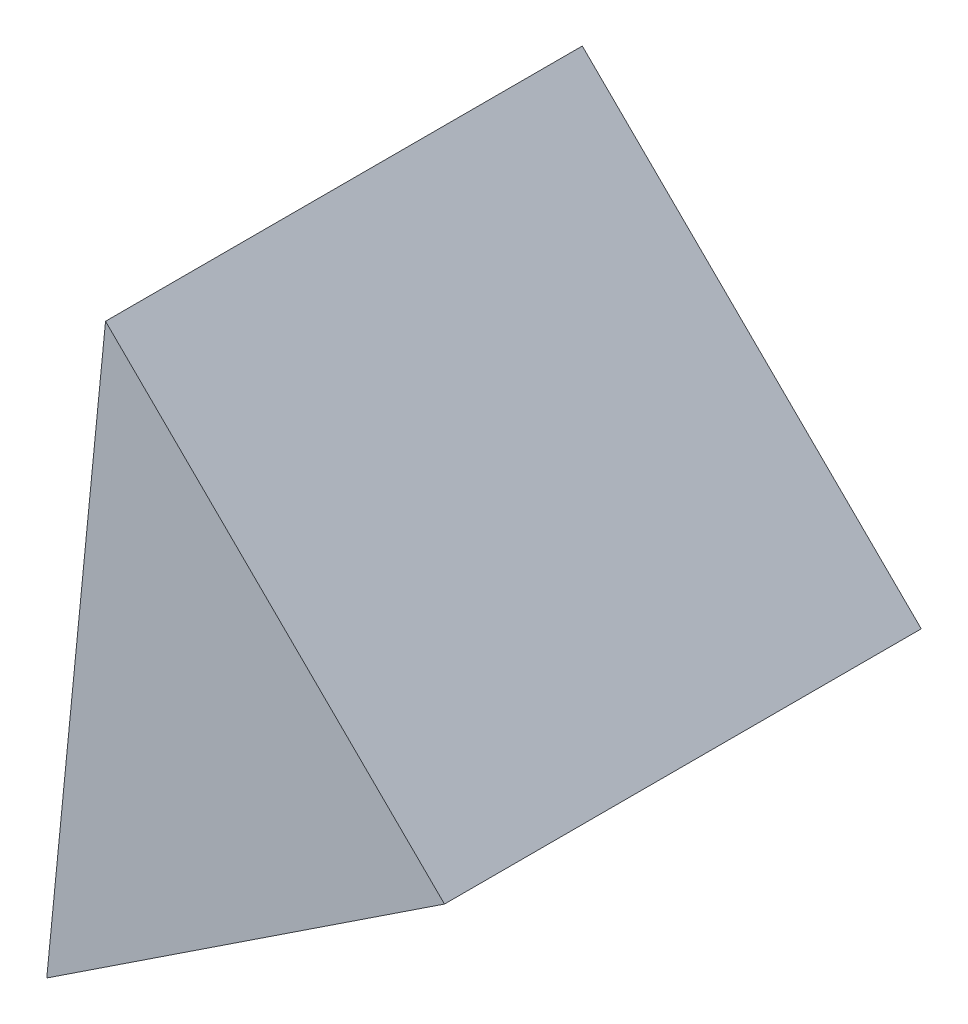
ISO-10303-21;
HEADER;
FILE_DESCRIPTION(('STEP AP214'),'2;1');
FILE_NAME('part.step','',(''),(''),'','','');
FILE_SCHEMA(('AUTOMOTIVE_DESIGN { 1 0 10303 214 1 1 1 1 }'));
ENDSEC;
DATA;
#1=APPLICATION_CONTEXT('core data for automotive mechanical design processes');
#2=APPLICATION_PROTOCOL_DEFINITION('international standard','automotive_design',2000,#1);
#3=PRODUCT_CONTEXT('',#1,'mechanical');
#4=PRODUCT('Part','Part','',(#3));
#5=PRODUCT_RELATED_PRODUCT_CATEGORY('part','',(#4));
#6=PRODUCT_DEFINITION_FORMATION('','',#4);
#7=PRODUCT_DEFINITION_CONTEXT('part definition',#1,'design');
#8=PRODUCT_DEFINITION('design','',#6,#7);
#9=PRODUCT_DEFINITION_SHAPE('','',#8);
#10=(LENGTH_UNIT() NAMED_UNIT(*) SI_UNIT(.MILLI.,.METRE.));
#11=(NAMED_UNIT(*) PLANE_ANGLE_UNIT() SI_UNIT($,.RADIAN.));
#12=(NAMED_UNIT(*) SI_UNIT($,.STERADIAN.) SOLID_ANGLE_UNIT());
#13=UNCERTAINTY_MEASURE_WITH_UNIT(LENGTH_MEASURE(1.E-05),#10,'distance_accuracy_value','');
#14=(GEOMETRIC_REPRESENTATION_CONTEXT(3) GLOBAL_UNCERTAINTY_ASSIGNED_CONTEXT((#13)) GLOBAL_UNIT_ASSIGNED_CONTEXT((#10,
#11,#12)) REPRESENTATION_CONTEXT('',''));
#15=CARTESIAN_POINT('',(0.,0.,0.));
#16=DIRECTION('',(0.,0.,1.));
#17=DIRECTION('',(1.,0.,0.));
#18=AXIS2_PLACEMENT_3D('',#15,#16,#17);
#19=CARTESIAN_POINT('',(4.85737091306617,3.60447873504105,5.));
#20=DIRECTION('',(-0.551401526003401,0.834239987726026,0.));
#21=DIRECTION('',(-0.834239987726026,-0.551401526003401,0.));
#22=AXIS2_PLACEMENT_3D('',#19,#20,#21);
#23=PLANE('',#22);
#24=DIRECTION('',(0.834239987726026,0.551401526003401,0.));
#25=VECTOR('',#24,1.);
#26=CARTESIAN_POINT('',(4.85737091306617,3.60447873504105,0.));
#27=LINE('',#26,#25);
#28=CARTESIAN_POINT('',(0.686170974436035,0.847471105024041,0.));
#29=VERTEX_POINT('',#28);
#30=CARTESIAN_POINT('',(4.85737091306617,3.60447873504105,0.));
#31=VERTEX_POINT('',#30);
#32=EDGE_CURVE('E81',#29,#31,#27,.T.);
#33=ORIENTED_EDGE('',*,*,#32,.T.);
#34=DIRECTION('',(0.,0.,-1.));
#35=VECTOR('',#34,1.);
#36=CARTESIAN_POINT('',(4.85737091306617,3.60447873504105,5.));
#37=LINE('',#36,#35);
#38=CARTESIAN_POINT('',(4.85737091306617,3.60447873504105,5.));
#39=VERTEX_POINT('',#38);
#40=EDGE_CURVE('E11',#39,#31,#37,.T.);
#41=ORIENTED_EDGE('',*,*,#40,.F.);
#42=DIRECTION('',(0.834239987726026,0.551401526003401,0.));
#43=VECTOR('',#42,1.);
#44=CARTESIAN_POINT('',(4.85737091306617,3.60447873504105,5.));
#45=LINE('',#44,#43);
#46=CARTESIAN_POINT('',(0.686170974436035,0.847471105024041,5.));
#47=VERTEX_POINT('',#46);
#48=EDGE_CURVE('E74',#47,#39,#45,.T.);
#49=ORIENTED_EDGE('',*,*,#48,.F.);
#50=DIRECTION('',(0.,0.,-1.));
#51=VECTOR('',#50,1.);
#52=CARTESIAN_POINT('',(0.686170974436035,0.847471105024041,5.));
#53=LINE('',#52,#51);
#54=EDGE_CURVE('E82',#47,#29,#53,.T.);
#55=ORIENTED_EDGE('',*,*,#54,.T.);
#56=EDGE_LOOP('',(#33,#41,#49,#55));
#57=FACE_BOUND('',#56,.T.);
#58=ADVANCED_FACE('F34',(#57),#23,.F.);
#59=CARTESIAN_POINT('',(4.85737091306617,3.60447873504105,5.));
#60=DIRECTION('',(-0.703219485005665,-0.710972823607462,0.));
#61=DIRECTION('',(0.710972823607462,-0.703219485005665,0.));
#62=AXIS2_PLACEMENT_3D('',#59,#60,#61);
#63=PLANE('',#62);
#64=DIRECTION('',(-0.710972823607462,0.703219485005665,0.));
#65=VECTOR('',#64,1.);
#66=CARTESIAN_POINT('',(4.85737091306617,3.60447873504105,0.));
#67=LINE('',#66,#65);
#68=CARTESIAN_POINT('',(1.30250679502886,7.12057616006937,0.));
#69=VERTEX_POINT('',#68);
#70=EDGE_CURVE('E62',#31,#69,#67,.T.);
#71=ORIENTED_EDGE('',*,*,#70,.T.);
#72=DIRECTION('',(0.,0.,-1.));
#73=VECTOR('',#72,1.);
#74=CARTESIAN_POINT('',(1.30250679502886,7.12057616006937,5.));
#75=LINE('',#74,#73);
#76=CARTESIAN_POINT('',(1.30250679502886,7.12057616006937,5.));
#77=VERTEX_POINT('',#76);
#78=EDGE_CURVE('E42',#77,#69,#75,.T.);
#79=ORIENTED_EDGE('',*,*,#78,.F.);
#80=DIRECTION('',(-0.710972823607462,0.703219485005665,0.));
#81=VECTOR('',#80,1.);
#82=CARTESIAN_POINT('',(4.85737091306617,3.60447873504105,5.));
#83=LINE('',#82,#81);
#84=EDGE_CURVE('E70',#39,#77,#83,.T.);
#85=ORIENTED_EDGE('',*,*,#84,.F.);
#86=ORIENTED_EDGE('',*,*,#40,.T.);
#87=EDGE_LOOP('',(#71,#79,#85,#86));
#88=FACE_BOUND('',#87,.T.);
#89=ADVANCED_FACE('F71',(#88),#63,.F.);
#90=CARTESIAN_POINT('',(0.686170974436035,0.847471105024041,5.));
#91=DIRECTION('',(0.995208082962372,-0.0977797095841542,0.));
#92=DIRECTION('',(0.0977797095841542,0.995208082962372,0.));
#93=AXIS2_PLACEMENT_3D('',#90,#91,#92);
#94=PLANE('',#93);
#95=DIRECTION('',(-0.0977797095841542,-0.995208082962372,0.));
#96=VECTOR('',#95,1.);
#97=CARTESIAN_POINT('',(0.686170974436035,0.847471105024041,0.));
#98=LINE('',#97,#96);
#99=EDGE_CURVE('E67',#69,#29,#98,.T.);
#100=ORIENTED_EDGE('',*,*,#99,.T.);
#101=ORIENTED_EDGE('',*,*,#54,.F.);
#102=DIRECTION('',(-0.0977797095841542,-0.995208082962372,0.));
#103=VECTOR('',#102,1.);
#104=CARTESIAN_POINT('',(0.686170974436035,0.847471105024041,5.));
#105=LINE('',#104,#103);
#106=EDGE_CURVE('E50',#77,#47,#105,.T.);
#107=ORIENTED_EDGE('',*,*,#106,.F.);
#108=ORIENTED_EDGE('',*,*,#78,.T.);
#109=EDGE_LOOP('',(#100,#101,#107,#108));
#110=FACE_BOUND('',#109,.T.);
#111=ADVANCED_FACE('F89',(#110),#94,.F.);
#112=CARTESIAN_POINT('',(0.,0.,5.));
#113=DIRECTION('',(0.,0.,-1.));
#114=DIRECTION('',(-1.,0.,0.));
#115=AXIS2_PLACEMENT_3D('',#112,#113,#114);
#116=PLANE('',#115);
#117=ORIENTED_EDGE('',*,*,#48,.T.);
#118=ORIENTED_EDGE('',*,*,#84,.T.);
#119=ORIENTED_EDGE('',*,*,#106,.T.);
#120=EDGE_LOOP('',(#117,#118,#119));
#121=FACE_BOUND('',#120,.T.);
#122=ADVANCED_FACE('F77',(#121),#116,.F.);
#123=CARTESIAN_POINT('',(0.,0.,0.));
#124=DIRECTION('',(0.,0.,-1.));
#125=DIRECTION('',(-1.,0.,0.));
#126=AXIS2_PLACEMENT_3D('',#123,#124,#125);
#127=PLANE('',#126);
#128=ORIENTED_EDGE('',*,*,#32,.F.);
#129=ORIENTED_EDGE('',*,*,#99,.F.);
#130=ORIENTED_EDGE('',*,*,#70,.F.);
#131=EDGE_LOOP('',(#128,#129,#130));
#132=FACE_BOUND('',#131,.T.);
#133=ADVANCED_FACE('F90',(#132),#127,.T.);
#134=CLOSED_SHELL('',(#58,#89,#111,#122,#133));
#135=MANIFOLD_SOLID_BREP('B2',#134);
#136=ADVANCED_BREP_SHAPE_REPRESENTATION('',(#18,#135),#14);
#137=SHAPE_DEFINITION_REPRESENTATION(#9,#136);
ENDSEC;
END-ISO-10303-21;
